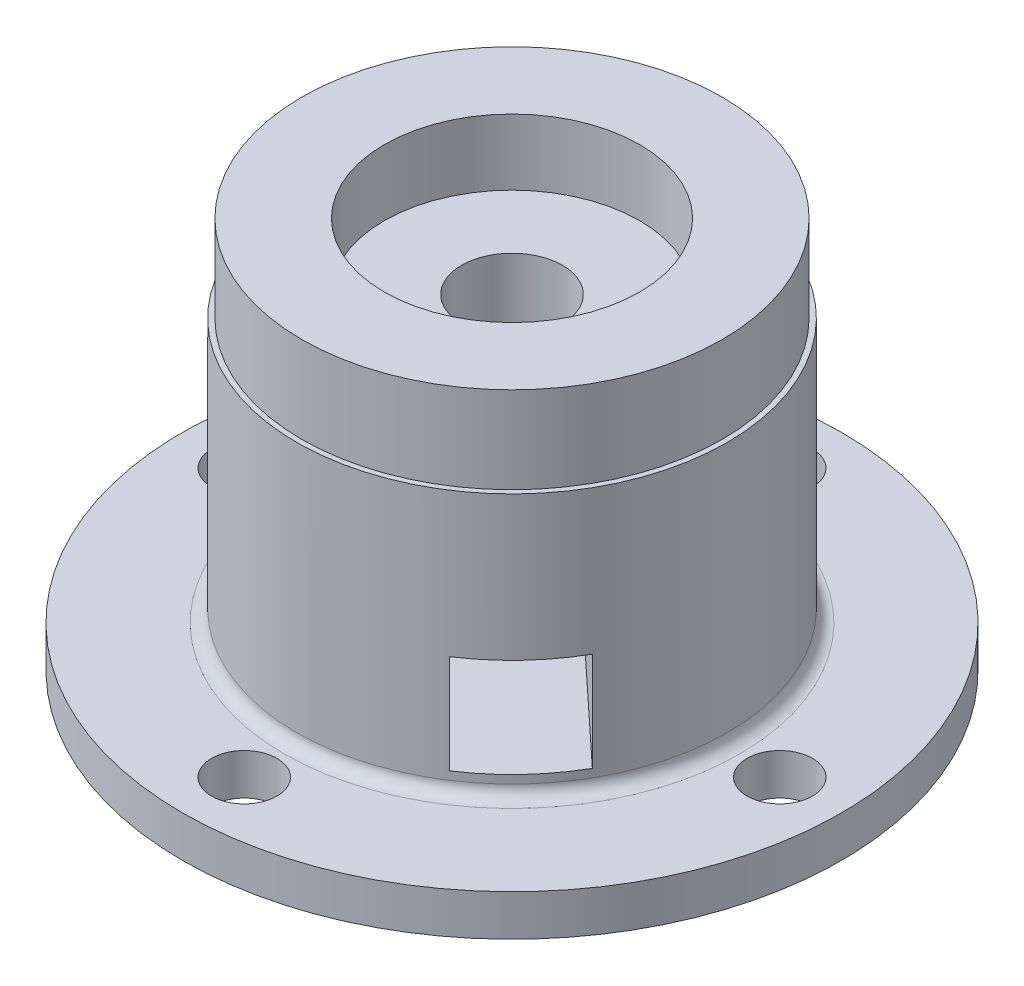
ISO-10303-21;
HEADER;
FILE_DESCRIPTION(('STEP AP214'),'2;1');
FILE_NAME('part.step','',(''),(''),'','','');
FILE_SCHEMA(('AUTOMOTIVE_DESIGN { 1 0 10303 214 1 1 1 1 }'));
ENDSEC;
DATA;
#1=APPLICATION_CONTEXT('core data for automotive mechanical design processes');
#2=APPLICATION_PROTOCOL_DEFINITION('international standard','automotive_design',2000,#1);
#3=PRODUCT_CONTEXT('',#1,'mechanical');
#4=PRODUCT('Part','Part','',(#3));
#5=PRODUCT_RELATED_PRODUCT_CATEGORY('part','',(#4));
#6=PRODUCT_DEFINITION_FORMATION('','',#4);
#7=PRODUCT_DEFINITION_CONTEXT('part definition',#1,'design');
#8=PRODUCT_DEFINITION('design','',#6,#7);
#9=PRODUCT_DEFINITION_SHAPE('','',#8);
#10=(LENGTH_UNIT() NAMED_UNIT(*) SI_UNIT(.MILLI.,.METRE.));
#11=(NAMED_UNIT(*) PLANE_ANGLE_UNIT() SI_UNIT($,.RADIAN.));
#12=(NAMED_UNIT(*) SI_UNIT($,.STERADIAN.) SOLID_ANGLE_UNIT());
#13=UNCERTAINTY_MEASURE_WITH_UNIT(LENGTH_MEASURE(1.E-05),#10,'distance_accuracy_value','');
#14=(GEOMETRIC_REPRESENTATION_CONTEXT(3) GLOBAL_UNCERTAINTY_ASSIGNED_CONTEXT((#13)) GLOBAL_UNIT_ASSIGNED_CONTEXT((#10,
#11,#12)) REPRESENTATION_CONTEXT('',''));
#15=CARTESIAN_POINT('',(0.,0.,0.));
#16=DIRECTION('',(0.,0.,1.));
#17=DIRECTION('',(1.,0.,0.));
#18=AXIS2_PLACEMENT_3D('',#15,#16,#17);
#19=CARTESIAN_POINT('',(0.,64.,0.));
#20=DIRECTION('',(0.,-1.,0.));
#21=DIRECTION('',(0.,0.,-1.));
#22=AXIS2_PLACEMENT_3D('',#19,#20,#21);
#23=CYLINDRICAL_SURFACE('',#22,52.25);
#24=CARTESIAN_POINT('',(0.,64.,0.));
#25=DIRECTION('',(0.,1.,0.));
#26=DIRECTION('',(1.,0.,0.));
#27=AXIS2_PLACEMENT_3D('',#24,#25,#26);
#28=CIRCLE('',#27,52.25);
#29=CARTESIAN_POINT('',(52.25,64.,0.));
#30=VERTEX_POINT('',#29);
#31=EDGE_CURVE('E146',#30,#30,#28,.T.);
#32=ORIENTED_EDGE('',*,*,#31,.F.);
#33=EDGE_LOOP('',(#32));
#34=FACE_BOUND('',#33,.T.);
#35=CARTESIAN_POINT('',(0.,3.,0.));
#36=DIRECTION('',(0.,1.,0.));
#37=DIRECTION('',(0.,0.,1.));
#38=AXIS2_PLACEMENT_3D('',#35,#36,#37);
#39=CIRCLE('',#38,52.25);
#40=CARTESIAN_POINT('',(0.,3.,52.25));
#41=VERTEX_POINT('',#40);
#42=EDGE_CURVE('E141',#41,#41,#39,.T.);
#43=ORIENTED_EDGE('',*,*,#42,.T.);
#44=EDGE_LOOP('',(#43));
#45=FACE_BOUND('',#44,.T.);
#46=DIRECTION('',(0.,-1.,0.));
#47=VECTOR('',#46,1.);
#48=CARTESIAN_POINT('',(45.3866480350156,64.,25.8865733565803));
#49=LINE('',#48,#47);
#50=CARTESIAN_POINT('',(45.3866480350156,29.,25.8865733565803));
#51=VERTEX_POINT('',#50);
#52=CARTESIAN_POINT('',(45.3866480350156,5.,25.8865733565803));
#53=VERTEX_POINT('',#52);
#54=EDGE_CURVE('E221',#51,#53,#49,.T.);
#55=ORIENTED_EDGE('',*,*,#54,.T.);
#56=CARTESIAN_POINT('',(0.,5.,0.));
#57=DIRECTION('',(0.,-1.,0.));
#58=DIRECTION('',(0.,0.,-1.));
#59=AXIS2_PLACEMENT_3D('',#56,#57,#58);
#60=CIRCLE('',#59,52.25);
#61=CARTESIAN_POINT('',(28.5969963242035,5.,43.7295586672618));
#62=VERTEX_POINT('',#61);
#63=EDGE_CURVE('E120',#53,#62,#60,.T.);
#64=ORIENTED_EDGE('',*,*,#63,.T.);
#65=DIRECTION('',(0.,-1.,0.));
#66=VECTOR('',#65,1.);
#67=CARTESIAN_POINT('',(28.5969963242034,64.,43.7295586672618));
#68=LINE('',#67,#66);
#69=CARTESIAN_POINT('',(28.5969963242034,29.,43.7295586672618));
#70=VERTEX_POINT('',#69);
#71=EDGE_CURVE('E215',#70,#62,#68,.T.);
#72=ORIENTED_EDGE('',*,*,#71,.F.);
#73=CARTESIAN_POINT('',(0.,29.,0.));
#74=DIRECTION('',(0.,-1.,0.));
#75=DIRECTION('',(0.,0.,-1.));
#76=AXIS2_PLACEMENT_3D('',#73,#74,#75);
#77=CIRCLE('',#76,52.25);
#78=EDGE_CURVE('E85',#51,#70,#77,.T.);
#79=ORIENTED_EDGE('',*,*,#78,.F.);
#80=EDGE_LOOP('',(#55,#64,#72,#79));
#81=FACE_BOUND('',#80,.T.);
#82=ADVANCED_FACE('F62',(#34,#45,#81),#23,.T.);
#83=CARTESIAN_POINT('',(0.,64.,0.));
#84=DIRECTION('',(0.,-1.,0.));
#85=DIRECTION('',(0.,0.,-1.));
#86=AXIS2_PLACEMENT_3D('',#83,#84,#85);
#87=CYLINDRICAL_SURFACE('',#86,12.25);
#88=CARTESIAN_POINT('',(0.,69.,0.));
#89=DIRECTION('',(0.,1.,0.));
#90=DIRECTION('',(0.,0.,1.));
#91=AXIS2_PLACEMENT_3D('',#88,#89,#90);
#92=CIRCLE('',#91,12.25);
#93=CARTESIAN_POINT('',(0.,69.,12.25));
#94=VERTEX_POINT('',#93);
#95=EDGE_CURVE('E177',#94,#94,#92,.T.);
#96=ORIENTED_EDGE('',*,*,#95,.T.);
#97=EDGE_LOOP('',(#96));
#98=FACE_BOUND('',#97,.T.);
#99=CARTESIAN_POINT('',(0.,30.,0.));
#100=DIRECTION('',(0.,-1.,0.));
#101=DIRECTION('',(0.,0.,-1.));
#102=AXIS2_PLACEMENT_3D('',#99,#100,#101);
#103=CIRCLE('',#102,12.25);
#104=CARTESIAN_POINT('',(0.,30.,-12.25));
#105=VERTEX_POINT('',#104);
#106=EDGE_CURVE('E132',#105,#105,#103,.T.);
#107=ORIENTED_EDGE('',*,*,#106,.T.);
#108=EDGE_LOOP('',(#107));
#109=FACE_BOUND('',#108,.T.);
#110=ADVANCED_FACE('F248',(#98,#109),#87,.F.);
#111=CARTESIAN_POINT('',(0.,80.,0.));
#112=DIRECTION('',(0.,-1.,0.));
#113=DIRECTION('',(0.,0.,-1.));
#114=AXIS2_PLACEMENT_3D('',#111,#112,#113);
#115=CYLINDRICAL_SURFACE('',#114,31.);
#116=CARTESIAN_POINT('',(0.,85.,0.));
#117=DIRECTION('',(0.,1.,0.));
#118=DIRECTION('',(0.,0.,1.));
#119=AXIS2_PLACEMENT_3D('',#116,#117,#118);
#120=CIRCLE('',#119,31.);
#121=CARTESIAN_POINT('',(0.,85.,31.));
#122=VERTEX_POINT('',#121);
#123=EDGE_CURVE('E173',#122,#122,#120,.T.);
#124=ORIENTED_EDGE('',*,*,#123,.T.);
#125=EDGE_LOOP('',(#124));
#126=FACE_BOUND('',#125,.T.);
#127=CARTESIAN_POINT('',(0.,69.,0.));
#128=DIRECTION('',(0.,1.,0.));
#129=DIRECTION('',(0.,0.,1.));
#130=AXIS2_PLACEMENT_3D('',#127,#128,#129);
#131=CIRCLE('',#130,31.);
#132=CARTESIAN_POINT('',(0.,69.,31.));
#133=VERTEX_POINT('',#132);
#134=EDGE_CURVE('E169',#133,#133,#131,.T.);
#135=ORIENTED_EDGE('',*,*,#134,.F.);
#136=EDGE_LOOP('',(#135));
#137=FACE_BOUND('',#136,.T.);
#138=ADVANCED_FACE('F254',(#126,#137),#115,.F.);
#139=CARTESIAN_POINT('',(0.,69.,0.));
#140=DIRECTION('',(0.,1.,0.));
#141=DIRECTION('',(0.,0.,1.));
#142=AXIS2_PLACEMENT_3D('',#139,#140,#141);
#143=PLANE('',#142);
#144=ORIENTED_EDGE('',*,*,#95,.F.);
#145=EDGE_LOOP('',(#144));
#146=FACE_BOUND('',#145,.T.);
#147=ORIENTED_EDGE('',*,*,#134,.T.);
#148=EDGE_LOOP('',(#147));
#149=FACE_BOUND('',#148,.T.);
#150=ADVANCED_FACE('F263',(#146,#149),#143,.T.);
#151=CARTESIAN_POINT('',(0.,64.,0.));
#152=DIRECTION('',(0.,1.,0.));
#153=DIRECTION('',(0.,0.,1.));
#154=AXIS2_PLACEMENT_3D('',#151,#152,#153);
#155=PLANE('',#154);
#156=CARTESIAN_POINT('',(0.,64.,0.));
#157=DIRECTION('',(0.,1.,0.));
#158=DIRECTION('',(1.,0.,0.));
#159=AXIS2_PLACEMENT_3D('',#156,#157,#158);
#160=CIRCLE('',#159,51.);
#161=CARTESIAN_POINT('',(0.,64.,-51.));
#162=VERTEX_POINT('',#161);
#163=EDGE_CURVE('E145',#162,#162,#160,.T.);
#164=ORIENTED_EDGE('',*,*,#163,.F.);
#165=EDGE_LOOP('',(#164));
#166=FACE_BOUND('',#165,.T.);
#167=ORIENTED_EDGE('',*,*,#31,.T.);
#168=EDGE_LOOP('',(#167));
#169=FACE_BOUND('',#168,.T.);
#170=ADVANCED_FACE('F260',(#166,#169),#155,.T.);
#171=CARTESIAN_POINT('',(0.,0.,0.));
#172=DIRECTION('',(0.,1.,0.));
#173=DIRECTION('',(0.,0.,1.));
#174=AXIS2_PLACEMENT_3D('',#171,#172,#173);
#175=PLANE('',#174);
#176=CARTESIAN_POINT('',(0.,0.,0.));
#177=DIRECTION('',(0.,1.,0.));
#178=DIRECTION('',(0.,0.,1.));
#179=AXIS2_PLACEMENT_3D('',#176,#177,#178);
#180=CIRCLE('',#179,55.25);
#181=CARTESIAN_POINT('',(0.,0.,55.25));
#182=VERTEX_POINT('',#181);
#183=EDGE_CURVE('E112',#182,#182,#180,.F.);
#184=ORIENTED_EDGE('',*,*,#183,.T.);
#185=EDGE_LOOP('',(#184));
#186=FACE_BOUND('',#185,.T.);
#187=CARTESIAN_POINT('',(0.,0.,-65.));
#188=DIRECTION('',(0.,1.,0.));
#189=DIRECTION('',(0.,0.,1.));
#190=AXIS2_PLACEMENT_3D('',#187,#188,#189);
#191=CIRCLE('',#190,7.94);
#192=CARTESIAN_POINT('',(0.,0.,-57.06));
#193=VERTEX_POINT('',#192);
#194=EDGE_CURVE('E205',#193,#193,#191,.T.);
#195=ORIENTED_EDGE('',*,*,#194,.F.);
#196=EDGE_LOOP('',(#195));
#197=FACE_BOUND('',#196,.T.);
#198=CARTESIAN_POINT('',(65.,0.,2.26946287024804E-13));
#199=DIRECTION('',(0.,1.,0.));
#200=DIRECTION('',(0.,0.,1.));
#201=AXIS2_PLACEMENT_3D('',#198,#199,#200);
#202=CIRCLE('',#201,7.94);
#203=CARTESIAN_POINT('',(65.,0.,7.94000000000023));
#204=VERTEX_POINT('',#203);
#205=EDGE_CURVE('E201',#204,#204,#202,.T.);
#206=ORIENTED_EDGE('',*,*,#205,.F.);
#207=EDGE_LOOP('',(#206));
#208=FACE_BOUND('',#207,.T.);
#209=CARTESIAN_POINT('',(-4.53892574049607E-13,0.,65.));
#210=DIRECTION('',(0.,1.,0.));
#211=DIRECTION('',(0.,0.,1.));
#212=AXIS2_PLACEMENT_3D('',#209,#210,#211);
#213=CIRCLE('',#212,7.94);
#214=CARTESIAN_POINT('',(-4.53892574049607E-13,0.,72.94));
#215=VERTEX_POINT('',#214);
#216=EDGE_CURVE('E193',#215,#215,#213,.T.);
#217=ORIENTED_EDGE('',*,*,#216,.F.);
#218=EDGE_LOOP('',(#217));
#219=FACE_BOUND('',#218,.T.);
#220=CARTESIAN_POINT('',(-65.,0.,-6.80838861074411E-13));
#221=DIRECTION('',(0.,1.,0.));
#222=DIRECTION('',(0.,0.,1.));
#223=AXIS2_PLACEMENT_3D('',#220,#221,#222);
#224=CIRCLE('',#223,7.94);
#225=CARTESIAN_POINT('',(-65.,0.,7.93999999999932));
#226=VERTEX_POINT('',#225);
#227=EDGE_CURVE('E185',#226,#226,#224,.T.);
#228=ORIENTED_EDGE('',*,*,#227,.F.);
#229=EDGE_LOOP('',(#228));
#230=FACE_BOUND('',#229,.T.);
#231=CARTESIAN_POINT('',(0.,0.,0.));
#232=DIRECTION('',(0.,1.,0.));
#233=DIRECTION('',(0.,0.,1.));
#234=AXIS2_PLACEMENT_3D('',#231,#232,#233);
#235=CIRCLE('',#234,80.);
#236=CARTESIAN_POINT('',(0.,0.,80.));
#237=VERTEX_POINT('',#236);
#238=EDGE_CURVE('E151',#237,#237,#235,.T.);
#239=ORIENTED_EDGE('',*,*,#238,.T.);
#240=EDGE_LOOP('',(#239));
#241=FACE_BOUND('',#240,.T.);
#242=ADVANCED_FACE('F262',(#186,#197,#208,#219,#230,#241),#175,.T.);
#243=CARTESIAN_POINT('',(0.,-10.,0.));
#244=DIRECTION('',(0.,1.,0.));
#245=DIRECTION('',(0.,0.,1.));
#246=AXIS2_PLACEMENT_3D('',#243,#244,#245);
#247=CYLINDRICAL_SURFACE('',#246,80.);
#248=CARTESIAN_POINT('',(0.,-10.,0.));
#249=DIRECTION('',(0.,1.,0.));
#250=DIRECTION('',(0.,0.,1.));
#251=AXIS2_PLACEMENT_3D('',#248,#249,#250);
#252=CIRCLE('',#251,80.);
#253=CARTESIAN_POINT('',(0.,-10.,80.));
#254=VERTEX_POINT('',#253);
#255=EDGE_CURVE('E150',#254,#254,#252,.T.);
#256=ORIENTED_EDGE('',*,*,#255,.T.);
#257=EDGE_LOOP('',(#256));
#258=FACE_BOUND('',#257,.T.);
#259=ORIENTED_EDGE('',*,*,#238,.F.);
#260=EDGE_LOOP('',(#259));
#261=FACE_BOUND('',#260,.T.);
#262=ADVANCED_FACE('F266',(#258,#261),#247,.T.);
#263=CARTESIAN_POINT('',(0.,-10.,0.));
#264=DIRECTION('',(0.,1.,0.));
#265=DIRECTION('',(0.,0.,1.));
#266=AXIS2_PLACEMENT_3D('',#263,#264,#265);
#267=PLANE('',#266);
#268=CARTESIAN_POINT('',(0.,-10.,-65.));
#269=DIRECTION('',(0.,1.,0.));
#270=DIRECTION('',(0.,0.,1.));
#271=AXIS2_PLACEMENT_3D('',#268,#269,#270);
#272=CIRCLE('',#271,7.94);
#273=CARTESIAN_POINT('',(0.,-10.,-57.06));
#274=VERTEX_POINT('',#273);
#275=EDGE_CURVE('E181',#274,#274,#272,.T.);
#276=ORIENTED_EDGE('',*,*,#275,.T.);
#277=EDGE_LOOP('',(#276));
#278=FACE_BOUND('',#277,.T.);
#279=CARTESIAN_POINT('',(65.,-10.,2.26946287024804E-13));
#280=DIRECTION('',(0.,1.,0.));
#281=DIRECTION('',(0.,0.,1.));
#282=AXIS2_PLACEMENT_3D('',#279,#280,#281);
#283=CIRCLE('',#282,7.94);
#284=CARTESIAN_POINT('',(65.,-10.,7.94000000000023));
#285=VERTEX_POINT('',#284);
#286=EDGE_CURVE('E197',#285,#285,#283,.T.);
#287=ORIENTED_EDGE('',*,*,#286,.T.);
#288=EDGE_LOOP('',(#287));
#289=FACE_BOUND('',#288,.T.);
#290=CARTESIAN_POINT('',(-4.53892574049607E-13,-10.,65.));
#291=DIRECTION('',(0.,1.,0.));
#292=DIRECTION('',(0.,0.,1.));
#293=AXIS2_PLACEMENT_3D('',#290,#291,#292);
#294=CIRCLE('',#293,7.94);
#295=CARTESIAN_POINT('',(-4.53892574049607E-13,-10.,72.94));
#296=VERTEX_POINT('',#295);
#297=EDGE_CURVE('E189',#296,#296,#294,.T.);
#298=ORIENTED_EDGE('',*,*,#297,.T.);
#299=EDGE_LOOP('',(#298));
#300=FACE_BOUND('',#299,.T.);
#301=CARTESIAN_POINT('',(-65.,-10.,-6.80838861074411E-13));
#302=DIRECTION('',(0.,1.,0.));
#303=DIRECTION('',(0.,0.,1.));
#304=AXIS2_PLACEMENT_3D('',#301,#302,#303);
#305=CIRCLE('',#304,7.94);
#306=CARTESIAN_POINT('',(-65.,-10.,7.93999999999932));
#307=VERTEX_POINT('',#306);
#308=EDGE_CURVE('E136',#307,#307,#305,.T.);
#309=ORIENTED_EDGE('',*,*,#308,.T.);
#310=EDGE_LOOP('',(#309));
#311=FACE_BOUND('',#310,.T.);
#312=CARTESIAN_POINT('',(0.,-10.,0.));
#313=DIRECTION('',(0.,1.,0.));
#314=DIRECTION('',(0.,0.,1.));
#315=AXIS2_PLACEMENT_3D('',#312,#313,#314);
#316=CIRCLE('',#315,17.25);
#317=CARTESIAN_POINT('',(0.,-10.,17.25));
#318=VERTEX_POINT('',#317);
#319=EDGE_CURVE('E155',#318,#318,#316,.T.);
#320=ORIENTED_EDGE('',*,*,#319,.T.);
#321=EDGE_LOOP('',(#320));
#322=FACE_BOUND('',#321,.T.);
#323=ORIENTED_EDGE('',*,*,#255,.F.);
#324=EDGE_LOOP('',(#323));
#325=FACE_BOUND('',#324,.T.);
#326=ADVANCED_FACE('F269',(#278,#289,#300,#311,#322,#325),#267,.F.);
#327=CARTESIAN_POINT('',(0.,-10.,0.));
#328=DIRECTION('',(0.,1.,0.));
#329=DIRECTION('',(0.,0.,1.));
#330=AXIS2_PLACEMENT_3D('',#327,#328,#329);
#331=CYLINDRICAL_SURFACE('',#330,17.25);
#332=DIRECTION('',(0.,1.,0.));
#333=VECTOR('',#332,1.);
#334=CARTESIAN_POINT('',(0.176348746234768,-10.,17.2490985596263));
#335=LINE('',#334,#333);
#336=CARTESIAN_POINT('',(0.17634874623478,5.,17.2490985596263));
#337=VERTEX_POINT('',#336);
#338=CARTESIAN_POINT('',(0.176348746234766,29.,17.2490985596263));
#339=VERTEX_POINT('',#338);
#340=EDGE_CURVE('E71',#337,#339,#335,.T.);
#341=ORIENTED_EDGE('',*,*,#340,.F.);
#342=CARTESIAN_POINT('',(0.,5.,0.));
#343=DIRECTION('',(0.,-1.,0.));
#344=DIRECTION('',(0.,0.,-1.));
#345=AXIS2_PLACEMENT_3D('',#342,#343,#344);
#346=CIRCLE('',#345,17.25);
#347=CARTESIAN_POINT('',(17.2467998635159,5.,-0.332256629473785));
#348=VERTEX_POINT('',#347);
#349=EDGE_CURVE('E14',#337,#348,#346,.F.);
#350=ORIENTED_EDGE('',*,*,#349,.T.);
#351=DIRECTION('',(0.,1.,0.));
#352=VECTOR('',#351,1.);
#353=CARTESIAN_POINT('',(17.2467998635159,-10.,-0.332256629473782));
#354=LINE('',#353,#352);
#355=CARTESIAN_POINT('',(17.2467998635159,29.,-0.332256629473782));
#356=VERTEX_POINT('',#355);
#357=EDGE_CURVE('E104',#348,#356,#354,.T.);
#358=ORIENTED_EDGE('',*,*,#357,.T.);
#359=CARTESIAN_POINT('',(0.,29.,0.));
#360=DIRECTION('',(0.,-1.,0.));
#361=DIRECTION('',(0.,0.,-1.));
#362=AXIS2_PLACEMENT_3D('',#359,#360,#361);
#363=CIRCLE('',#362,17.25);
#364=EDGE_CURVE('E111',#339,#356,#363,.F.);
#365=ORIENTED_EDGE('',*,*,#364,.F.);
#366=EDGE_LOOP('',(#341,#350,#358,#365));
#367=FACE_BOUND('',#366,.T.);
#368=ORIENTED_EDGE('',*,*,#319,.F.);
#369=EDGE_LOOP('',(#368));
#370=FACE_BOUND('',#369,.T.);
#371=CARTESIAN_POINT('',(0.,30.,0.));
#372=DIRECTION('',(0.,-1.,0.));
#373=DIRECTION('',(0.,0.,-1.));
#374=AXIS2_PLACEMENT_3D('',#371,#372,#373);
#375=CIRCLE('',#374,17.25);
#376=CARTESIAN_POINT('',(0.,30.,-17.25));
#377=VERTEX_POINT('',#376);
#378=EDGE_CURVE('E137',#377,#377,#375,.T.);
#379=ORIENTED_EDGE('',*,*,#378,.F.);
#380=EDGE_LOOP('',(#379));
#381=FACE_BOUND('',#380,.T.);
#382=ADVANCED_FACE('F124',(#367,#370,#381),#331,.F.);
#383=CARTESIAN_POINT('',(0.,85.,0.));
#384=DIRECTION('',(0.,1.,0.));
#385=DIRECTION('',(0.,0.,1.));
#386=AXIS2_PLACEMENT_3D('',#383,#384,#385);
#387=PLANE('',#386);
#388=ORIENTED_EDGE('',*,*,#123,.F.);
#389=EDGE_LOOP('',(#388));
#390=FACE_BOUND('',#389,.T.);
#391=CARTESIAN_POINT('',(0.,85.,0.));
#392=DIRECTION('',(0.,1.,0.));
#393=DIRECTION('',(1.,0.,0.));
#394=AXIS2_PLACEMENT_3D('',#391,#392,#393);
#395=CIRCLE('',#394,51.);
#396=CARTESIAN_POINT('',(0.,85.,-51.));
#397=VERTEX_POINT('',#396);
#398=EDGE_CURVE('E162',#397,#397,#395,.T.);
#399=ORIENTED_EDGE('',*,*,#398,.T.);
#400=EDGE_LOOP('',(#399));
#401=FACE_BOUND('',#400,.T.);
#402=ADVANCED_FACE('F278',(#390,#401),#387,.T.);
#403=CARTESIAN_POINT('',(0.,85.,0.));
#404=DIRECTION('',(0.,-1.,0.));
#405=DIRECTION('',(0.,0.,-1.));
#406=AXIS2_PLACEMENT_3D('',#403,#404,#405);
#407=CYLINDRICAL_SURFACE('',#406,51.);
#408=CARTESIAN_POINT('',(0.,85.,-51.));
#409=CARTESIAN_POINT('',(0.,84.78125,-51.));
#410=CARTESIAN_POINT('',(0.,84.5625,-51.));
#411=CARTESIAN_POINT('',(0.,84.125,-51.));
#412=CARTESIAN_POINT('',(0.,83.90625,-51.));
#413=CARTESIAN_POINT('',(0.,83.46875,-51.));
#414=CARTESIAN_POINT('',(0.,83.25,-51.));
#415=CARTESIAN_POINT('',(0.,82.8125,-51.));
#416=CARTESIAN_POINT('',(0.,82.59375,-51.));
#417=CARTESIAN_POINT('',(0.,82.15625,-51.));
#418=CARTESIAN_POINT('',(0.,81.9375,-51.));
#419=CARTESIAN_POINT('',(0.,81.5,-51.));
#420=CARTESIAN_POINT('',(0.,81.28125,-51.));
#421=CARTESIAN_POINT('',(0.,80.84375,-51.));
#422=CARTESIAN_POINT('',(0.,80.625,-51.));
#423=CARTESIAN_POINT('',(0.,80.1875,-51.));
#424=CARTESIAN_POINT('',(0.,79.96875,-51.));
#425=CARTESIAN_POINT('',(0.,79.53125,-51.));
#426=CARTESIAN_POINT('',(0.,79.3125,-51.));
#427=CARTESIAN_POINT('',(0.,78.875,-51.));
#428=CARTESIAN_POINT('',(0.,78.65625,-51.));
#429=CARTESIAN_POINT('',(0.,78.21875,-51.));
#430=CARTESIAN_POINT('',(0.,78.,-51.));
#431=CARTESIAN_POINT('',(0.,77.5625,-51.));
#432=CARTESIAN_POINT('',(0.,77.34375,-51.));
#433=CARTESIAN_POINT('',(0.,76.90625,-51.));
#434=CARTESIAN_POINT('',(0.,76.6875,-51.));
#435=CARTESIAN_POINT('',(0.,76.25,-51.));
#436=CARTESIAN_POINT('',(0.,76.03125,-51.));
#437=CARTESIAN_POINT('',(0.,75.59375,-51.));
#438=CARTESIAN_POINT('',(0.,75.375,-51.));
#439=CARTESIAN_POINT('',(0.,74.9375,-51.));
#440=CARTESIAN_POINT('',(0.,74.71875,-51.));
#441=CARTESIAN_POINT('',(0.,74.28125,-51.));
#442=CARTESIAN_POINT('',(0.,74.0625,-51.));
#443=CARTESIAN_POINT('',(0.,73.625,-51.));
#444=CARTESIAN_POINT('',(0.,73.40625,-51.));
#445=CARTESIAN_POINT('',(0.,72.96875,-51.));
#446=CARTESIAN_POINT('',(0.,72.75,-51.));
#447=CARTESIAN_POINT('',(0.,72.3125,-51.));
#448=CARTESIAN_POINT('',(0.,72.09375,-51.));
#449=CARTESIAN_POINT('',(0.,71.65625,-51.));
#450=CARTESIAN_POINT('',(0.,71.4375,-51.));
#451=CARTESIAN_POINT('',(0.,71.,-51.));
#452=CARTESIAN_POINT('',(0.,70.78125,-51.));
#453=CARTESIAN_POINT('',(0.,70.34375,-51.));
#454=CARTESIAN_POINT('',(0.,70.125,-51.));
#455=CARTESIAN_POINT('',(0.,69.6875,-51.));
#456=CARTESIAN_POINT('',(0.,69.46875,-51.));
#457=CARTESIAN_POINT('',(0.,69.03125,-51.));
#458=CARTESIAN_POINT('',(0.,68.8125,-51.));
#459=CARTESIAN_POINT('',(0.,68.375,-51.));
#460=CARTESIAN_POINT('',(0.,68.15625,-51.));
#461=CARTESIAN_POINT('',(0.,67.71875,-51.));
#462=CARTESIAN_POINT('',(0.,67.5,-51.));
#463=CARTESIAN_POINT('',(0.,67.0625,-51.));
#464=CARTESIAN_POINT('',(0.,66.84375,-51.));
#465=CARTESIAN_POINT('',(0.,66.40625,-51.));
#466=CARTESIAN_POINT('',(0.,66.1875,-51.));
#467=CARTESIAN_POINT('',(0.,65.75,-51.));
#468=CARTESIAN_POINT('',(0.,65.53125,-51.));
#469=CARTESIAN_POINT('',(0.,65.09375,-51.));
#470=CARTESIAN_POINT('',(0.,64.875,-51.));
#471=CARTESIAN_POINT('',(0.,64.4375,-51.));
#472=CARTESIAN_POINT('',(0.,64.21875,-51.));
#473=CARTESIAN_POINT('',(0.,64.,-51.));
#474=B_SPLINE_CURVE_WITH_KNOTS('',3,(#408,#409,#410,#411,#412,#413,#414,#415,#416,#417,#418,
#419,#420,#421,#422,#423,#424,#425,#426,#427,#428,#429,#430,#431,#432,#433,#434,#435,#436,#437,
#438,#439,#440,#441,#442,#443,#444,#445,#446,#447,#448,#449,#450,#451,#452,#453,#454,#455,#456,
#457,#458,#459,#460,#461,#462,#463,#464,#465,#466,#467,#468,#469,#470,#471,#472,#473),
.UNSPECIFIED.,.F.,.F.,(4,2,2,2,2,2,2,2,2,2,2,2,2,2,2,2,2,2,2,2,2,2,2,2,2,2,2,2,2,2,2,2,4),(0.,
0.656250000000011,1.31250000000001,1.96875000000001,2.625,3.28125000000001,3.93750000000001,
4.59375000000001,5.25,5.90625000000002,6.56250000000001,7.21875000000001,7.87500000000001,
8.53125,9.18750000000001,9.84375000000001,10.5,11.15625,11.8125,12.46875,13.125,13.78125,
14.4375,15.09375,15.75,16.40625,17.0625,17.71875,18.375,19.03125,19.6875,20.34375,21.),.UNSPECIFIED.);
#475=EDGE_CURVE('BSEAM279',#397,#162,#474,.T.);
#476=ORIENTED_EDGE('',*,*,#398,.F.);
#477=ORIENTED_EDGE('',*,*,#163,.T.);
#478=ORIENTED_EDGE('',*,*,#475,.T.);
#479=ORIENTED_EDGE('',*,*,#475,.F.);
#480=EDGE_LOOP('',(#476,#478,#477,#479));
#481=FACE_BOUND('',#480,.T.);
#482=ADVANCED_FACE('F279',(#481),#407,.T.);
#483=CARTESIAN_POINT('',(-65.,-10.,-6.80838861074411E-13));
#484=DIRECTION('',(0.,1.,0.));
#485=DIRECTION('',(0.,0.,1.));
#486=AXIS2_PLACEMENT_3D('',#483,#484,#485);
#487=CYLINDRICAL_SURFACE('',#486,7.94);
#488=ORIENTED_EDGE('',*,*,#308,.F.);
#489=EDGE_LOOP('',(#488));
#490=FACE_BOUND('',#489,.T.);
#491=ORIENTED_EDGE('',*,*,#227,.T.);
#492=EDGE_LOOP('',(#491));
#493=FACE_BOUND('',#492,.T.);
#494=ADVANCED_FACE('F282',(#490,#493),#487,.F.);
#495=CARTESIAN_POINT('',(-4.53892574049607E-13,-10.,65.));
#496=DIRECTION('',(0.,1.,0.));
#497=DIRECTION('',(0.,0.,1.));
#498=AXIS2_PLACEMENT_3D('',#495,#496,#497);
#499=CYLINDRICAL_SURFACE('',#498,7.94);
#500=ORIENTED_EDGE('',*,*,#297,.F.);
#501=EDGE_LOOP('',(#500));
#502=FACE_BOUND('',#501,.T.);
#503=ORIENTED_EDGE('',*,*,#216,.T.);
#504=EDGE_LOOP('',(#503));
#505=FACE_BOUND('',#504,.T.);
#506=ADVANCED_FACE('F295',(#502,#505),#499,.F.);
#507=CARTESIAN_POINT('',(65.,-10.,2.26946287024804E-13));
#508=DIRECTION('',(0.,1.,0.));
#509=DIRECTION('',(0.,0.,1.));
#510=AXIS2_PLACEMENT_3D('',#507,#508,#509);
#511=CYLINDRICAL_SURFACE('',#510,7.94);
#512=ORIENTED_EDGE('',*,*,#286,.F.);
#513=EDGE_LOOP('',(#512));
#514=FACE_BOUND('',#513,.T.);
#515=ORIENTED_EDGE('',*,*,#205,.T.);
#516=EDGE_LOOP('',(#515));
#517=FACE_BOUND('',#516,.T.);
#518=ADVANCED_FACE('F299',(#514,#517),#511,.F.);
#519=CARTESIAN_POINT('',(0.,-10.,-65.));
#520=DIRECTION('',(0.,1.,0.));
#521=DIRECTION('',(0.,0.,1.));
#522=AXIS2_PLACEMENT_3D('',#519,#520,#521);
#523=CYLINDRICAL_SURFACE('',#522,7.94);
#524=ORIENTED_EDGE('',*,*,#275,.F.);
#525=EDGE_LOOP('',(#524));
#526=FACE_BOUND('',#525,.T.);
#527=ORIENTED_EDGE('',*,*,#194,.T.);
#528=EDGE_LOOP('',(#527));
#529=FACE_BOUND('',#528,.T.);
#530=ADVANCED_FACE('F303',(#526,#529),#523,.F.);
#531=CARTESIAN_POINT('',(0.,3.,0.));
#532=DIRECTION('',(0.,1.,0.));
#533=DIRECTION('',(0.,0.,1.));
#534=AXIS2_PLACEMENT_3D('',#531,#532,#533);
#535=TOROIDAL_SURFACE('',#534,55.25,3.);
#536=ORIENTED_EDGE('',*,*,#183,.F.);
#537=EDGE_LOOP('',(#536));
#538=FACE_BOUND('',#537,.T.);
#539=ORIENTED_EDGE('',*,*,#42,.F.);
#540=EDGE_LOOP('',(#539));
#541=FACE_BOUND('',#540,.T.);
#542=ADVANCED_FACE('F64',(#538,#541),#535,.F.);
#543=CARTESIAN_POINT('',(0.,30.,0.));
#544=DIRECTION('',(0.,-1.,0.));
#545=DIRECTION('',(0.,0.,-1.));
#546=AXIS2_PLACEMENT_3D('',#543,#544,#545);
#547=PLANE('',#546);
#548=ORIENTED_EDGE('',*,*,#106,.F.);
#549=EDGE_LOOP('',(#548));
#550=FACE_BOUND('',#549,.T.);
#551=ORIENTED_EDGE('',*,*,#378,.T.);
#552=EDGE_LOOP('',(#551));
#553=FACE_BOUND('',#552,.T.);
#554=ADVANCED_FACE('F246',(#550,#553),#547,.T.);
#555=CARTESIAN_POINT('',(-1.02178428670387,0.,16.1327582688102));
#556=DIRECTION('',(0.681692307692313,0.,-0.731638980394791));
#557=DIRECTION('',(-0.731638980394791,0.,-0.681692307692313));
#558=AXIS2_PLACEMENT_3D('',#555,#556,#557);
#559=PLANE('',#558);
#560=ORIENTED_EDGE('',*,*,#71,.T.);
#561=DIRECTION('',(0.731638980394791,0.,0.681692307692313));
#562=VECTOR('',#561,1.);
#563=CARTESIAN_POINT('',(-1.02178428670386,5.,16.1327582688102));
#564=LINE('',#563,#562);
#565=EDGE_CURVE('E122',#337,#62,#564,.T.);
#566=ORIENTED_EDGE('',*,*,#565,.F.);
#567=ORIENTED_EDGE('',*,*,#340,.T.);
#568=DIRECTION('',(0.731638980394791,0.,0.681692307692313));
#569=VECTOR('',#568,1.);
#570=CARTESIAN_POINT('',(-1.02178428670387,29.,16.1327582688102));
#571=LINE('',#570,#569);
#572=EDGE_CURVE('E224',#339,#70,#571,.T.);
#573=ORIENTED_EDGE('',*,*,#572,.T.);
#574=EDGE_LOOP('',(#560,#566,#567,#573));
#575=FACE_BOUND('',#574,.T.);
#576=ADVANCED_FACE('F233',(#575),#559,.T.);
#577=CARTESIAN_POINT('',(7.4992995490466,29.,6.98734615384622));
#578=DIRECTION('',(0.,-1.,0.));
#579=DIRECTION('',(0.,0.,-1.));
#580=AXIS2_PLACEMENT_3D('',#577,#578,#579);
#581=PLANE('',#580);
#582=ORIENTED_EDGE('',*,*,#78,.T.);
#583=ORIENTED_EDGE('',*,*,#572,.F.);
#584=ORIENTED_EDGE('',*,*,#364,.T.);
#585=DIRECTION('',(0.731638980394791,0.,0.681692307692313));
#586=VECTOR('',#585,1.);
#587=CARTESIAN_POINT('',(15.6796772517578,29.,-1.79239675086222));
#588=LINE('',#587,#586);
#589=EDGE_CURVE('E78',#356,#51,#588,.T.);
#590=ORIENTED_EDGE('',*,*,#589,.T.);
#591=EDGE_LOOP('',(#582,#583,#584,#590));
#592=FACE_BOUND('',#591,.T.);
#593=ADVANCED_FACE('F236',(#592),#581,.T.);
#594=CARTESIAN_POINT('',(15.6796772517578,0.,-1.79239675086221));
#595=DIRECTION('',(0.681692307692313,0.,-0.731638980394791));
#596=DIRECTION('',(-0.731638980394791,0.,-0.681692307692313));
#597=AXIS2_PLACEMENT_3D('',#594,#595,#596);
#598=PLANE('',#597);
#599=ORIENTED_EDGE('',*,*,#589,.F.);
#600=ORIENTED_EDGE('',*,*,#357,.F.);
#601=DIRECTION('',(0.731638980394791,0.,0.681692307692313));
#602=VECTOR('',#601,1.);
#603=CARTESIAN_POINT('',(15.6796772517578,5.,-1.79239675086222));
#604=LINE('',#603,#602);
#605=EDGE_CURVE('E107',#348,#53,#604,.T.);
#606=ORIENTED_EDGE('',*,*,#605,.T.);
#607=ORIENTED_EDGE('',*,*,#54,.F.);
#608=EDGE_LOOP('',(#599,#600,#606,#607));
#609=FACE_BOUND('',#608,.T.);
#610=ADVANCED_FACE('F106',(#609),#598,.F.);
#611=CARTESIAN_POINT('',(-1.02178428670386,5.,16.1327582688102));
#612=DIRECTION('',(0.,-1.,0.));
#613=DIRECTION('',(0.,0.,-1.));
#614=AXIS2_PLACEMENT_3D('',#611,#612,#613);
#615=PLANE('',#614);
#616=ORIENTED_EDGE('',*,*,#605,.F.);
#617=ORIENTED_EDGE('',*,*,#349,.F.);
#618=ORIENTED_EDGE('',*,*,#565,.T.);
#619=ORIENTED_EDGE('',*,*,#63,.F.);
#620=EDGE_LOOP('',(#616,#617,#618,#619));
#621=FACE_BOUND('',#620,.T.);
#622=ADVANCED_FACE('F117',(#621),#615,.F.);
#623=CLOSED_SHELL('',(#82,#110,#138,#150,#170,#242,#262,#326,#382,#402,#482,#494,#506,#518,#530,
#542,#554,#576,#593,#610,#622));
#624=MANIFOLD_SOLID_BREP('B2',#623);
#625=ADVANCED_BREP_SHAPE_REPRESENTATION('',(#18,#624),#14);
#626=SHAPE_DEFINITION_REPRESENTATION(#9,#625);
ENDSEC;
END-ISO-10303-21;
